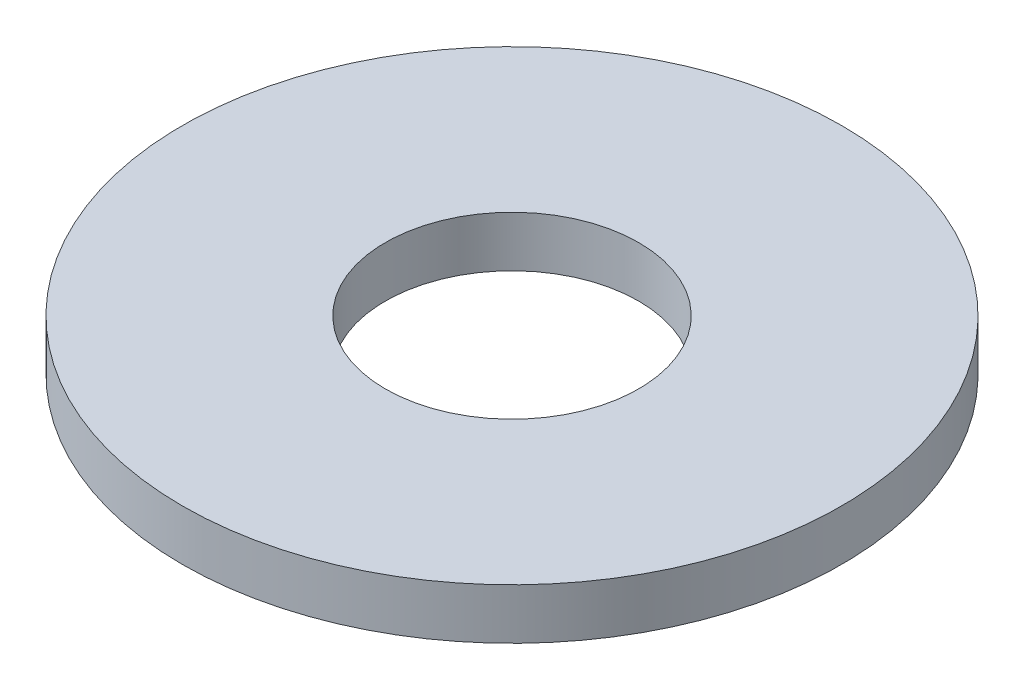
ISO-10303-21;
HEADER;
FILE_DESCRIPTION(('STEP AP214'),'2;1');
FILE_NAME('part.step','',(''),(''),'','','');
FILE_SCHEMA(('AUTOMOTIVE_DESIGN { 1 0 10303 214 1 1 1 1 }'));
ENDSEC;
DATA;
#1=APPLICATION_CONTEXT('core data for automotive mechanical design processes');
#2=APPLICATION_PROTOCOL_DEFINITION('international standard','automotive_design',2000,#1);
#3=PRODUCT_CONTEXT('',#1,'mechanical');
#4=PRODUCT('Part','Part','',(#3));
#5=PRODUCT_RELATED_PRODUCT_CATEGORY('part','',(#4));
#6=PRODUCT_DEFINITION_FORMATION('','',#4);
#7=PRODUCT_DEFINITION_CONTEXT('part definition',#1,'design');
#8=PRODUCT_DEFINITION('design','',#6,#7);
#9=PRODUCT_DEFINITION_SHAPE('','',#8);
#10=(LENGTH_UNIT() NAMED_UNIT(*) SI_UNIT(.MILLI.,.METRE.));
#11=(NAMED_UNIT(*) PLANE_ANGLE_UNIT() SI_UNIT($,.RADIAN.));
#12=(NAMED_UNIT(*) SI_UNIT($,.STERADIAN.) SOLID_ANGLE_UNIT());
#13=UNCERTAINTY_MEASURE_WITH_UNIT(LENGTH_MEASURE(1.E-05),#10,'distance_accuracy_value','');
#14=(GEOMETRIC_REPRESENTATION_CONTEXT(3) GLOBAL_UNCERTAINTY_ASSIGNED_CONTEXT((#13)) GLOBAL_UNIT_ASSIGNED_CONTEXT((#10,
#11,#12)) REPRESENTATION_CONTEXT('',''));
#15=CARTESIAN_POINT('',(0.,0.,0.));
#16=DIRECTION('',(0.,0.,1.));
#17=DIRECTION('',(1.,0.,0.));
#18=AXIS2_PLACEMENT_3D('',#15,#16,#17);
#19=CARTESIAN_POINT('',(0.,-1.,0.));
#20=DIRECTION('',(0.,1.,0.));
#21=DIRECTION('',(0.,0.,1.));
#22=AXIS2_PLACEMENT_3D('',#19,#20,#21);
#23=CYLINDRICAL_SURFACE('',#22,6.5);
#24=CARTESIAN_POINT('',(0.,-1.,0.));
#25=DIRECTION('',(0.,1.,0.));
#26=DIRECTION('',(0.,0.,1.));
#27=AXIS2_PLACEMENT_3D('',#24,#25,#26);
#28=CIRCLE('',#27,6.5);
#29=CARTESIAN_POINT('',(0.,-1.,6.5));
#30=VERTEX_POINT('',#29);
#31=EDGE_CURVE('E47',#30,#30,#28,.T.);
#32=ORIENTED_EDGE('',*,*,#31,.T.);
#33=EDGE_LOOP('',(#32));
#34=FACE_BOUND('',#33,.T.);
#35=CARTESIAN_POINT('',(0.,0.,0.));
#36=DIRECTION('',(0.,1.,0.));
#37=DIRECTION('',(0.,0.,1.));
#38=AXIS2_PLACEMENT_3D('',#35,#36,#37);
#39=CIRCLE('',#38,6.5);
#40=CARTESIAN_POINT('',(0.,0.,6.5));
#41=VERTEX_POINT('',#40);
#42=EDGE_CURVE('E54',#41,#41,#39,.T.);
#43=ORIENTED_EDGE('',*,*,#42,.F.);
#44=EDGE_LOOP('',(#43));
#45=FACE_BOUND('',#44,.T.);
#46=ADVANCED_FACE('F39',(#34,#45),#23,.T.);
#47=CARTESIAN_POINT('',(0.,-1.,0.));
#48=DIRECTION('',(0.,1.,0.));
#49=DIRECTION('',(0.,0.,1.));
#50=AXIS2_PLACEMENT_3D('',#47,#48,#49);
#51=CYLINDRICAL_SURFACE('',#50,2.5);
#52=CARTESIAN_POINT('',(0.,-1.,0.));
#53=DIRECTION('',(0.,1.,0.));
#54=DIRECTION('',(0.,0.,1.));
#55=AXIS2_PLACEMENT_3D('',#52,#53,#54);
#56=CIRCLE('',#55,2.5);
#57=CARTESIAN_POINT('',(0.,-1.,2.5));
#58=VERTEX_POINT('',#57);
#59=EDGE_CURVE('E10',#58,#58,#56,.T.);
#60=ORIENTED_EDGE('',*,*,#59,.F.);
#61=EDGE_LOOP('',(#60));
#62=FACE_BOUND('',#61,.T.);
#63=CARTESIAN_POINT('',(0.,0.,0.));
#64=DIRECTION('',(0.,1.,0.));
#65=DIRECTION('',(0.,0.,1.));
#66=AXIS2_PLACEMENT_3D('',#63,#64,#65);
#67=CIRCLE('',#66,2.5);
#68=CARTESIAN_POINT('',(0.,0.,2.5));
#69=VERTEX_POINT('',#68);
#70=EDGE_CURVE('E42',#69,#69,#67,.T.);
#71=ORIENTED_EDGE('',*,*,#70,.T.);
#72=EDGE_LOOP('',(#71));
#73=FACE_BOUND('',#72,.T.);
#74=ADVANCED_FACE('F63',(#62,#73),#51,.F.);
#75=CARTESIAN_POINT('',(0.,-1.,0.));
#76=DIRECTION('',(0.,1.,0.));
#77=DIRECTION('',(0.,0.,1.));
#78=AXIS2_PLACEMENT_3D('',#75,#76,#77);
#79=PLANE('',#78);
#80=ORIENTED_EDGE('',*,*,#31,.F.);
#81=EDGE_LOOP('',(#80));
#82=FACE_BOUND('',#81,.T.);
#83=ORIENTED_EDGE('',*,*,#59,.T.);
#84=EDGE_LOOP('',(#83));
#85=FACE_BOUND('',#84,.T.);
#86=ADVANCED_FACE('F67',(#82,#85),#79,.F.);
#87=CARTESIAN_POINT('',(0.,0.,0.));
#88=DIRECTION('',(0.,1.,0.));
#89=DIRECTION('',(0.,0.,1.));
#90=AXIS2_PLACEMENT_3D('',#87,#88,#89);
#91=PLANE('',#90);
#92=ORIENTED_EDGE('',*,*,#42,.T.);
#93=EDGE_LOOP('',(#92));
#94=FACE_BOUND('',#93,.T.);
#95=ORIENTED_EDGE('',*,*,#70,.F.);
#96=EDGE_LOOP('',(#95));
#97=FACE_BOUND('',#96,.T.);
#98=ADVANCED_FACE('F65',(#94,#97),#91,.T.);
#99=CLOSED_SHELL('',(#46,#74,#86,#98));
#100=MANIFOLD_SOLID_BREP('B2',#99);
#101=ADVANCED_BREP_SHAPE_REPRESENTATION('',(#18,#100),#14);
#102=SHAPE_DEFINITION_REPRESENTATION(#9,#101);
ENDSEC;
END-ISO-10303-21;
